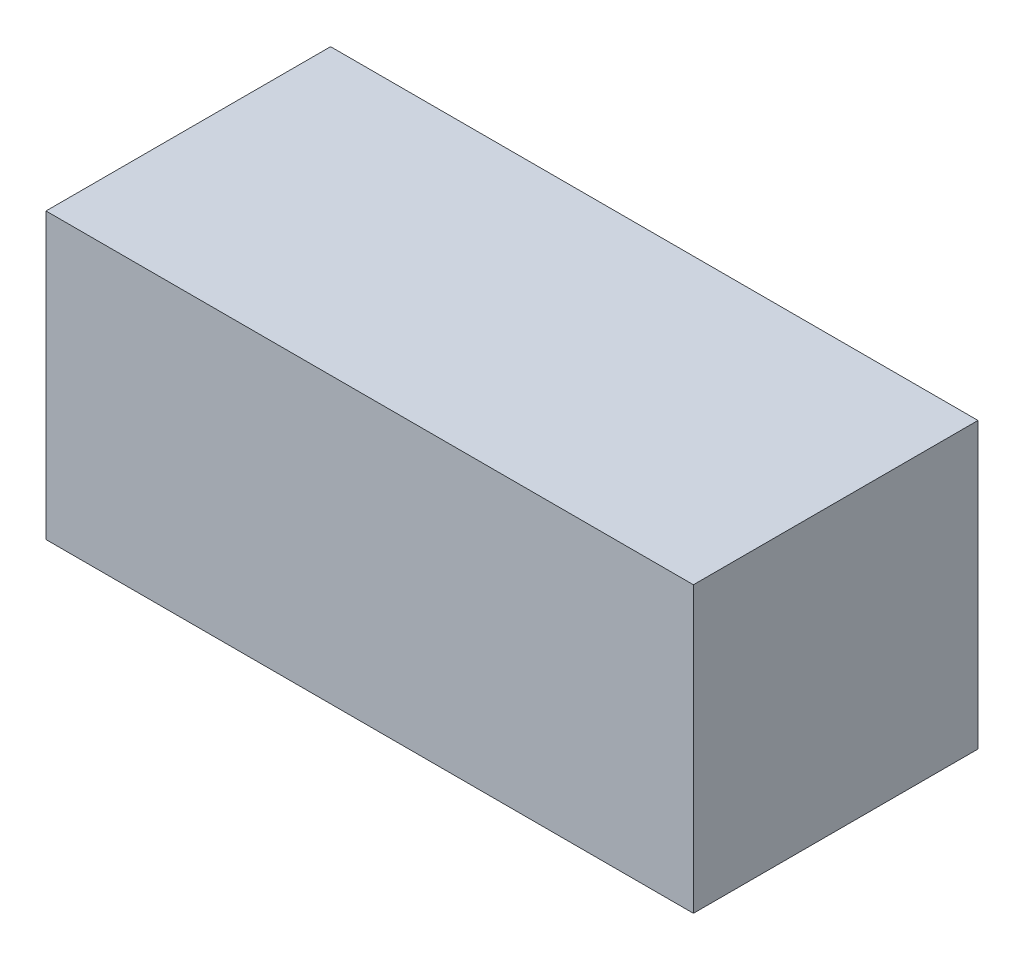
ISO-10303-21;
HEADER;
FILE_DESCRIPTION(('STEP AP214'),'2;1');
FILE_NAME('part.step','',(''),(''),'','','');
FILE_SCHEMA(('AUTOMOTIVE_DESIGN { 1 0 10303 214 1 1 1 1 }'));
ENDSEC;
DATA;
#1=APPLICATION_CONTEXT('core data for automotive mechanical design processes');
#2=APPLICATION_PROTOCOL_DEFINITION('international standard','automotive_design',2000,#1);
#3=PRODUCT_CONTEXT('',#1,'mechanical');
#4=PRODUCT('Part','Part','',(#3));
#5=PRODUCT_RELATED_PRODUCT_CATEGORY('part','',(#4));
#6=PRODUCT_DEFINITION_FORMATION('','',#4);
#7=PRODUCT_DEFINITION_CONTEXT('part definition',#1,'design');
#8=PRODUCT_DEFINITION('design','',#6,#7);
#9=PRODUCT_DEFINITION_SHAPE('','',#8);
#10=(LENGTH_UNIT() NAMED_UNIT(*) SI_UNIT(.MILLI.,.METRE.));
#11=(NAMED_UNIT(*) PLANE_ANGLE_UNIT() SI_UNIT($,.RADIAN.));
#12=(NAMED_UNIT(*) SI_UNIT($,.STERADIAN.) SOLID_ANGLE_UNIT());
#13=UNCERTAINTY_MEASURE_WITH_UNIT(LENGTH_MEASURE(1.E-05),#10,'distance_accuracy_value','');
#14=(GEOMETRIC_REPRESENTATION_CONTEXT(3) GLOBAL_UNCERTAINTY_ASSIGNED_CONTEXT((#13)) GLOBAL_UNIT_ASSIGNED_CONTEXT((#10,
#11,#12)) REPRESENTATION_CONTEXT('',''));
#15=CARTESIAN_POINT('',(0.,0.,0.));
#16=DIRECTION('',(0.,0.,1.));
#17=DIRECTION('',(1.,0.,0.));
#18=AXIS2_PLACEMENT_3D('',#15,#16,#17);
#19=CARTESIAN_POINT('',(568.75,500.,-250.));
#20=DIRECTION('',(-1.,0.,0.));
#21=DIRECTION('',(0.,0.,1.));
#22=AXIS2_PLACEMENT_3D('',#19,#20,#21);
#23=PLANE('',#22);
#24=DIRECTION('',(0.,0.,-1.));
#25=VECTOR('',#24,1.);
#26=CARTESIAN_POINT('',(568.75,0.,-250.));
#27=LINE('',#26,#25);
#28=CARTESIAN_POINT('',(568.75,0.,250.));
#29=VERTEX_POINT('',#28);
#30=CARTESIAN_POINT('',(568.75,0.,-250.));
#31=VERTEX_POINT('',#30);
#32=EDGE_CURVE('E96',#29,#31,#27,.T.);
#33=ORIENTED_EDGE('',*,*,#32,.T.);
#34=DIRECTION('',(0.,-1.,0.));
#35=VECTOR('',#34,1.);
#36=CARTESIAN_POINT('',(568.75,500.,-250.));
#37=LINE('',#36,#35);
#38=CARTESIAN_POINT('',(568.75,500.,-250.));
#39=VERTEX_POINT('',#38);
#40=EDGE_CURVE('E11',#39,#31,#37,.T.);
#41=ORIENTED_EDGE('',*,*,#40,.F.);
#42=DIRECTION('',(0.,0.,-1.));
#43=VECTOR('',#42,1.);
#44=CARTESIAN_POINT('',(568.75,500.,-250.));
#45=LINE('',#44,#43);
#46=CARTESIAN_POINT('',(568.75,500.,250.));
#47=VERTEX_POINT('',#46);
#48=EDGE_CURVE('E84',#47,#39,#45,.T.);
#49=ORIENTED_EDGE('',*,*,#48,.F.);
#50=DIRECTION('',(0.,-1.,0.));
#51=VECTOR('',#50,1.);
#52=CARTESIAN_POINT('',(568.75,500.,250.));
#53=LINE('',#52,#51);
#54=EDGE_CURVE('E92',#47,#29,#53,.T.);
#55=ORIENTED_EDGE('',*,*,#54,.T.);
#56=EDGE_LOOP('',(#33,#41,#49,#55));
#57=FACE_BOUND('',#56,.T.);
#58=ADVANCED_FACE('F33',(#57),#23,.F.);
#59=CARTESIAN_POINT('',(-568.75,500.,-250.));
#60=DIRECTION('',(0.,0.,1.));
#61=DIRECTION('',(1.,0.,0.));
#62=AXIS2_PLACEMENT_3D('',#59,#60,#61);
#63=PLANE('',#62);
#64=DIRECTION('',(-1.,0.,0.));
#65=VECTOR('',#64,1.);
#66=CARTESIAN_POINT('',(-568.75,0.,-250.));
#67=LINE('',#66,#65);
#68=CARTESIAN_POINT('',(-568.75,0.,-250.));
#69=VERTEX_POINT('',#68);
#70=EDGE_CURVE('E88',#31,#69,#67,.T.);
#71=ORIENTED_EDGE('',*,*,#70,.T.);
#72=DIRECTION('',(0.,-1.,0.));
#73=VECTOR('',#72,1.);
#74=CARTESIAN_POINT('',(-568.75,500.,-250.));
#75=LINE('',#74,#73);
#76=CARTESIAN_POINT('',(-568.75,500.,-250.));
#77=VERTEX_POINT('',#76);
#78=EDGE_CURVE('E41',#77,#69,#75,.T.);
#79=ORIENTED_EDGE('',*,*,#78,.F.);
#80=DIRECTION('',(-1.,0.,0.));
#81=VECTOR('',#80,1.);
#82=CARTESIAN_POINT('',(-568.75,500.,-250.));
#83=LINE('',#82,#81);
#84=EDGE_CURVE('E79',#39,#77,#83,.T.);
#85=ORIENTED_EDGE('',*,*,#84,.F.);
#86=ORIENTED_EDGE('',*,*,#40,.T.);
#87=EDGE_LOOP('',(#71,#79,#85,#86));
#88=FACE_BOUND('',#87,.T.);
#89=ADVANCED_FACE('F87',(#88),#63,.F.);
#90=CARTESIAN_POINT('',(-568.75,500.,-250.));
#91=DIRECTION('',(1.,0.,0.));
#92=DIRECTION('',(0.,0.,-1.));
#93=AXIS2_PLACEMENT_3D('',#90,#91,#92);
#94=PLANE('',#93);
#95=DIRECTION('',(0.,0.,1.));
#96=VECTOR('',#95,1.);
#97=CARTESIAN_POINT('',(-568.75,0.,-250.));
#98=LINE('',#97,#96);
#99=CARTESIAN_POINT('',(-568.75,0.,250.));
#100=VERTEX_POINT('',#99);
#101=EDGE_CURVE('E66',#69,#100,#98,.T.);
#102=ORIENTED_EDGE('',*,*,#101,.T.);
#103=DIRECTION('',(0.,-1.,0.));
#104=VECTOR('',#103,1.);
#105=CARTESIAN_POINT('',(-568.75,500.,250.));
#106=LINE('',#105,#104);
#107=CARTESIAN_POINT('',(-568.75,500.,250.));
#108=VERTEX_POINT('',#107);
#109=EDGE_CURVE('E89',#108,#100,#106,.T.);
#110=ORIENTED_EDGE('',*,*,#109,.F.);
#111=DIRECTION('',(0.,0.,1.));
#112=VECTOR('',#111,1.);
#113=CARTESIAN_POINT('',(-568.75,500.,-250.));
#114=LINE('',#113,#112);
#115=EDGE_CURVE('E82',#77,#108,#114,.T.);
#116=ORIENTED_EDGE('',*,*,#115,.F.);
#117=ORIENTED_EDGE('',*,*,#78,.T.);
#118=EDGE_LOOP('',(#102,#110,#116,#117));
#119=FACE_BOUND('',#118,.T.);
#120=ADVANCED_FACE('F90',(#119),#94,.F.);
#121=CARTESIAN_POINT('',(-568.75,500.,250.));
#122=DIRECTION('',(0.,0.,-1.));
#123=DIRECTION('',(-1.,0.,0.));
#124=AXIS2_PLACEMENT_3D('',#121,#122,#123);
#125=PLANE('',#124);
#126=DIRECTION('',(1.,0.,0.));
#127=VECTOR('',#126,1.);
#128=CARTESIAN_POINT('',(-568.75,0.,250.));
#129=LINE('',#128,#127);
#130=EDGE_CURVE('E72',#100,#29,#129,.T.);
#131=ORIENTED_EDGE('',*,*,#130,.T.);
#132=ORIENTED_EDGE('',*,*,#54,.F.);
#133=DIRECTION('',(1.,0.,0.));
#134=VECTOR('',#133,1.);
#135=CARTESIAN_POINT('',(-568.75,500.,250.));
#136=LINE('',#135,#134);
#137=EDGE_CURVE('E49',#108,#47,#136,.T.);
#138=ORIENTED_EDGE('',*,*,#137,.F.);
#139=ORIENTED_EDGE('',*,*,#109,.T.);
#140=EDGE_LOOP('',(#131,#132,#138,#139));
#141=FACE_BOUND('',#140,.T.);
#142=ADVANCED_FACE('F103',(#141),#125,.F.);
#143=CARTESIAN_POINT('',(0.,500.,0.));
#144=DIRECTION('',(0.,1.,0.));
#145=DIRECTION('',(0.,0.,1.));
#146=AXIS2_PLACEMENT_3D('',#143,#144,#145);
#147=PLANE('',#146);
#148=ORIENTED_EDGE('',*,*,#48,.T.);
#149=ORIENTED_EDGE('',*,*,#84,.T.);
#150=ORIENTED_EDGE('',*,*,#115,.T.);
#151=ORIENTED_EDGE('',*,*,#137,.T.);
#152=EDGE_LOOP('',(#148,#149,#150,#151));
#153=FACE_BOUND('',#152,.T.);
#154=ADVANCED_FACE('F80',(#153),#147,.T.);
#155=CARTESIAN_POINT('',(0.,0.,0.));
#156=DIRECTION('',(0.,1.,0.));
#157=DIRECTION('',(0.,0.,1.));
#158=AXIS2_PLACEMENT_3D('',#155,#156,#157);
#159=PLANE('',#158);
#160=ORIENTED_EDGE('',*,*,#32,.F.);
#161=ORIENTED_EDGE('',*,*,#130,.F.);
#162=ORIENTED_EDGE('',*,*,#101,.F.);
#163=ORIENTED_EDGE('',*,*,#70,.F.);
#164=EDGE_LOOP('',(#160,#161,#162,#163));
#165=FACE_BOUND('',#164,.T.);
#166=ADVANCED_FACE('F106',(#165),#159,.F.);
#167=CLOSED_SHELL('',(#58,#89,#120,#142,#154,#166));
#168=MANIFOLD_SOLID_BREP('B2',#167);
#169=ADVANCED_BREP_SHAPE_REPRESENTATION('',(#18,#168),#14);
#170=SHAPE_DEFINITION_REPRESENTATION(#9,#169);
ENDSEC;
END-ISO-10303-21;
